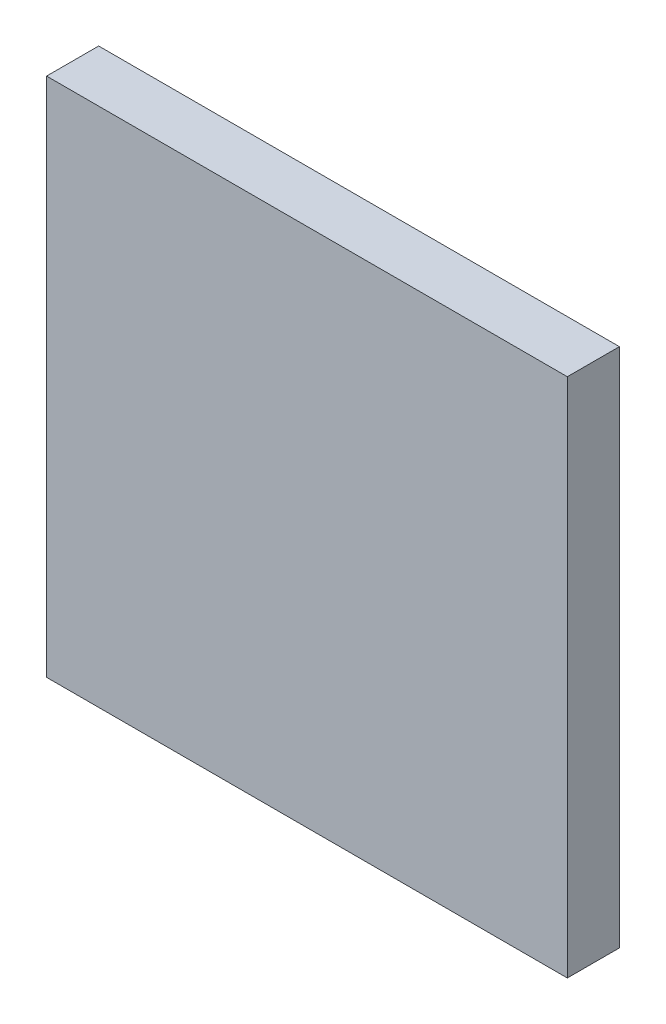
ISO-10303-21;
HEADER;
FILE_DESCRIPTION(('STEP AP214'),'2;1');
FILE_NAME('part.step','',(''),(''),'','','');
FILE_SCHEMA(('AUTOMOTIVE_DESIGN { 1 0 10303 214 1 1 1 1 }'));
ENDSEC;
DATA;
#1=APPLICATION_CONTEXT('core data for automotive mechanical design processes');
#2=APPLICATION_PROTOCOL_DEFINITION('international standard','automotive_design',2000,#1);
#3=PRODUCT_CONTEXT('',#1,'mechanical');
#4=PRODUCT('Part','Part','',(#3));
#5=PRODUCT_RELATED_PRODUCT_CATEGORY('part','',(#4));
#6=PRODUCT_DEFINITION_FORMATION('','',#4);
#7=PRODUCT_DEFINITION_CONTEXT('part definition',#1,'design');
#8=PRODUCT_DEFINITION('design','',#6,#7);
#9=PRODUCT_DEFINITION_SHAPE('','',#8);
#10=(LENGTH_UNIT() NAMED_UNIT(*) SI_UNIT(.MILLI.,.METRE.));
#11=(NAMED_UNIT(*) PLANE_ANGLE_UNIT() SI_UNIT($,.RADIAN.));
#12=(NAMED_UNIT(*) SI_UNIT($,.STERADIAN.) SOLID_ANGLE_UNIT());
#13=UNCERTAINTY_MEASURE_WITH_UNIT(LENGTH_MEASURE(1.E-05),#10,'distance_accuracy_value','');
#14=(GEOMETRIC_REPRESENTATION_CONTEXT(3) GLOBAL_UNCERTAINTY_ASSIGNED_CONTEXT((#13)) GLOBAL_UNIT_ASSIGNED_CONTEXT((#10,
#11,#12)) REPRESENTATION_CONTEXT('',''));
#15=CARTESIAN_POINT('',(0.,0.,0.));
#16=DIRECTION('',(0.,0.,1.));
#17=DIRECTION('',(1.,0.,0.));
#18=AXIS2_PLACEMENT_3D('',#15,#16,#17);
#19=CARTESIAN_POINT('',(2500.,-2500.,500.));
#20=DIRECTION('',(-1.,0.,0.));
#21=DIRECTION('',(0.,0.,1.));
#22=AXIS2_PLACEMENT_3D('',#19,#20,#21);
#23=PLANE('',#22);
#24=DIRECTION('',(0.,1.,0.));
#25=VECTOR('',#24,1.);
#26=CARTESIAN_POINT('',(2500.,-2500.,0.));
#27=LINE('',#26,#25);
#28=CARTESIAN_POINT('',(2500.,-2500.,0.));
#29=VERTEX_POINT('',#28);
#30=CARTESIAN_POINT('',(2500.,2500.,0.));
#31=VERTEX_POINT('',#30);
#32=EDGE_CURVE('E107',#29,#31,#27,.T.);
#33=ORIENTED_EDGE('',*,*,#32,.T.);
#34=DIRECTION('',(0.,0.,-1.));
#35=VECTOR('',#34,1.);
#36=CARTESIAN_POINT('',(2500.,2500.,500.));
#37=LINE('',#36,#35);
#38=CARTESIAN_POINT('',(2500.,2500.,500.));
#39=VERTEX_POINT('',#38);
#40=EDGE_CURVE('E11',#39,#31,#37,.T.);
#41=ORIENTED_EDGE('',*,*,#40,.F.);
#42=DIRECTION('',(0.,1.,0.));
#43=VECTOR('',#42,1.);
#44=CARTESIAN_POINT('',(2500.,-2500.,500.));
#45=LINE('',#44,#43);
#46=CARTESIAN_POINT('',(2500.,-2500.,500.));
#47=VERTEX_POINT('',#46);
#48=EDGE_CURVE('E91',#47,#39,#45,.T.);
#49=ORIENTED_EDGE('',*,*,#48,.F.);
#50=DIRECTION('',(0.,0.,-1.));
#51=VECTOR('',#50,1.);
#52=CARTESIAN_POINT('',(2500.,-2500.,500.));
#53=LINE('',#52,#51);
#54=EDGE_CURVE('E103',#47,#29,#53,.T.);
#55=ORIENTED_EDGE('',*,*,#54,.T.);
#56=EDGE_LOOP('',(#33,#41,#49,#55));
#57=FACE_BOUND('',#56,.T.);
#58=ADVANCED_FACE('F39',(#57),#23,.F.);
#59=CARTESIAN_POINT('',(-2500.,2500.,500.));
#60=DIRECTION('',(0.,-1.,0.));
#61=DIRECTION('',(0.,0.,-1.));
#62=AXIS2_PLACEMENT_3D('',#59,#60,#61);
#63=PLANE('',#62);
#64=DIRECTION('',(-1.,0.,0.));
#65=VECTOR('',#64,1.);
#66=CARTESIAN_POINT('',(-2500.,2500.,0.));
#67=LINE('',#66,#65);
#68=CARTESIAN_POINT('',(-2500.,2500.,0.));
#69=VERTEX_POINT('',#68);
#70=EDGE_CURVE('E96',#31,#69,#67,.T.);
#71=ORIENTED_EDGE('',*,*,#70,.T.);
#72=DIRECTION('',(0.,0.,-1.));
#73=VECTOR('',#72,1.);
#74=CARTESIAN_POINT('',(-2500.,2500.,500.));
#75=LINE('',#74,#73);
#76=CARTESIAN_POINT('',(-2500.,2500.,500.));
#77=VERTEX_POINT('',#76);
#78=EDGE_CURVE('E48',#77,#69,#75,.T.);
#79=ORIENTED_EDGE('',*,*,#78,.F.);
#80=DIRECTION('',(-1.,0.,0.));
#81=VECTOR('',#80,1.);
#82=CARTESIAN_POINT('',(-2500.,2500.,500.));
#83=LINE('',#82,#81);
#84=EDGE_CURVE('E86',#39,#77,#83,.T.);
#85=ORIENTED_EDGE('',*,*,#84,.F.);
#86=ORIENTED_EDGE('',*,*,#40,.T.);
#87=EDGE_LOOP('',(#71,#79,#85,#86));
#88=FACE_BOUND('',#87,.T.);
#89=ADVANCED_FACE('F95',(#88),#63,.F.);
#90=CARTESIAN_POINT('',(-2500.,-2500.,500.));
#91=DIRECTION('',(1.,0.,0.));
#92=DIRECTION('',(0.,0.,-1.));
#93=AXIS2_PLACEMENT_3D('',#90,#91,#92);
#94=PLANE('',#93);
#95=DIRECTION('',(0.,-1.,0.));
#96=VECTOR('',#95,1.);
#97=CARTESIAN_POINT('',(-2500.,-2500.,0.));
#98=LINE('',#97,#96);
#99=CARTESIAN_POINT('',(-2500.,-2500.,0.));
#100=VERTEX_POINT('',#99);
#101=EDGE_CURVE('E73',#69,#100,#98,.T.);
#102=ORIENTED_EDGE('',*,*,#101,.T.);
#103=DIRECTION('',(0.,0.,-1.));
#104=VECTOR('',#103,1.);
#105=CARTESIAN_POINT('',(-2500.,-2500.,500.));
#106=LINE('',#105,#104);
#107=CARTESIAN_POINT('',(-2500.,-2500.,500.));
#108=VERTEX_POINT('',#107);
#109=EDGE_CURVE('E98',#108,#100,#106,.T.);
#110=ORIENTED_EDGE('',*,*,#109,.F.);
#111=DIRECTION('',(0.,-1.,0.));
#112=VECTOR('',#111,1.);
#113=CARTESIAN_POINT('',(-2500.,-2500.,500.));
#114=LINE('',#113,#112);
#115=EDGE_CURVE('E89',#77,#108,#114,.T.);
#116=ORIENTED_EDGE('',*,*,#115,.F.);
#117=ORIENTED_EDGE('',*,*,#78,.T.);
#118=EDGE_LOOP('',(#102,#110,#116,#117));
#119=FACE_BOUND('',#118,.T.);
#120=ADVANCED_FACE('F99',(#119),#94,.F.);
#121=CARTESIAN_POINT('',(-2500.,-2500.,500.));
#122=DIRECTION('',(0.,1.,0.));
#123=DIRECTION('',(0.,0.,1.));
#124=AXIS2_PLACEMENT_3D('',#121,#122,#123);
#125=PLANE('',#124);
#126=DIRECTION('',(1.,0.,0.));
#127=VECTOR('',#126,1.);
#128=CARTESIAN_POINT('',(-2500.,-2500.,0.));
#129=LINE('',#128,#127);
#130=EDGE_CURVE('E79',#100,#29,#129,.T.);
#131=ORIENTED_EDGE('',*,*,#130,.T.);
#132=ORIENTED_EDGE('',*,*,#54,.F.);
#133=DIRECTION('',(1.,0.,0.));
#134=VECTOR('',#133,1.);
#135=CARTESIAN_POINT('',(-2500.,-2500.,500.));
#136=LINE('',#135,#134);
#137=EDGE_CURVE('E56',#108,#47,#136,.T.);
#138=ORIENTED_EDGE('',*,*,#137,.F.);
#139=ORIENTED_EDGE('',*,*,#109,.T.);
#140=EDGE_LOOP('',(#131,#132,#138,#139));
#141=FACE_BOUND('',#140,.T.);
#142=ADVANCED_FACE('F120',(#141),#125,.F.);
#143=CARTESIAN_POINT('',(0.,0.,500.));
#144=DIRECTION('',(0.,0.,-1.));
#145=DIRECTION('',(-1.,0.,0.));
#146=AXIS2_PLACEMENT_3D('',#143,#144,#145);
#147=PLANE('',#146);
#148=ORIENTED_EDGE('',*,*,#48,.T.);
#149=ORIENTED_EDGE('',*,*,#84,.T.);
#150=ORIENTED_EDGE('',*,*,#115,.T.);
#151=ORIENTED_EDGE('',*,*,#137,.T.);
#152=EDGE_LOOP('',(#148,#149,#150,#151));
#153=FACE_BOUND('',#152,.T.);
#154=ADVANCED_FACE('F87',(#153),#147,.F.);
#155=CARTESIAN_POINT('',(0.,0.,0.));
#156=DIRECTION('',(0.,0.,-1.));
#157=DIRECTION('',(-1.,0.,0.));
#158=AXIS2_PLACEMENT_3D('',#155,#156,#157);
#159=PLANE('',#158);
#160=ORIENTED_EDGE('',*,*,#32,.F.);
#161=ORIENTED_EDGE('',*,*,#130,.F.);
#162=ORIENTED_EDGE('',*,*,#101,.F.);
#163=ORIENTED_EDGE('',*,*,#70,.F.);
#164=EDGE_LOOP('',(#160,#161,#162,#163));
#165=FACE_BOUND('',#164,.T.);
#166=ADVANCED_FACE('F123',(#165),#159,.T.);
#167=CLOSED_SHELL('',(#58,#89,#120,#142,#154,#166));
#168=MANIFOLD_SOLID_BREP('B2',#167);
#169=ADVANCED_BREP_SHAPE_REPRESENTATION('',(#18,#168),#14);
#170=SHAPE_DEFINITION_REPRESENTATION(#9,#169);
ENDSEC;
END-ISO-10303-21;
